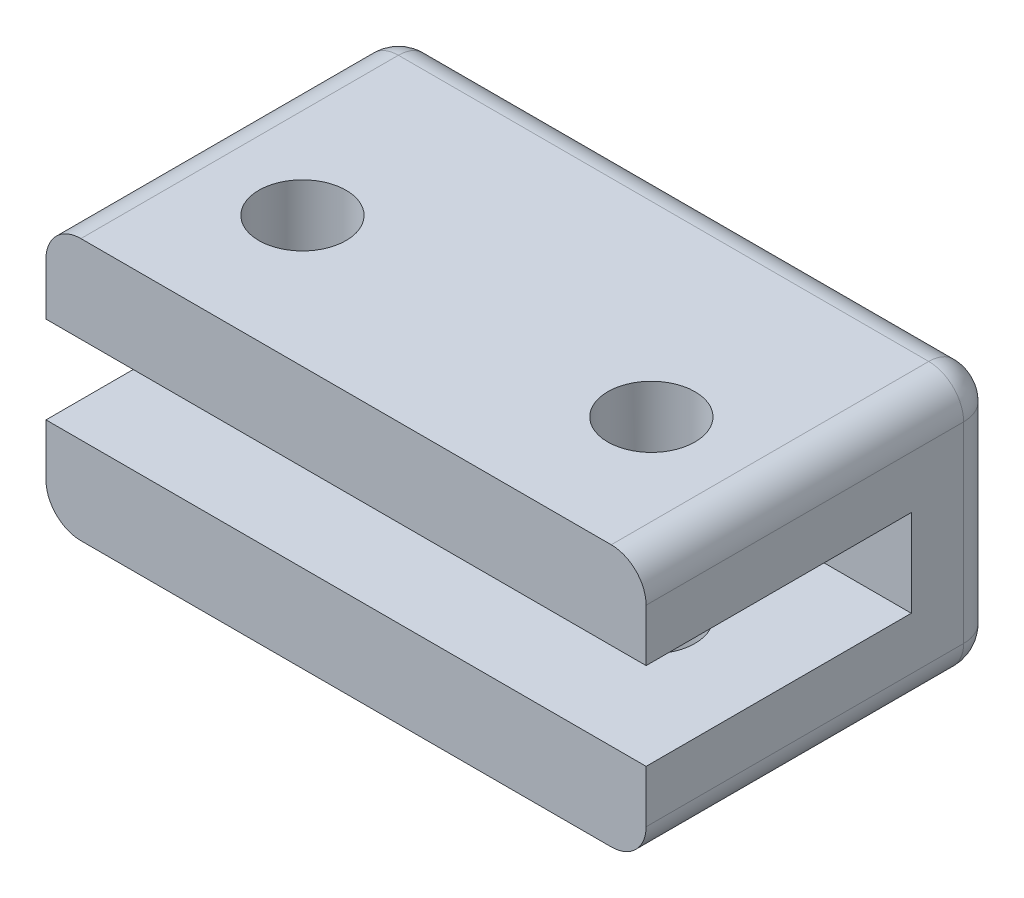
ISO-10303-21;
HEADER;
FILE_DESCRIPTION(('STEP AP214'),'2;1');
FILE_NAME('part.step','',(''),(''),'','','');
FILE_SCHEMA(('AUTOMOTIVE_DESIGN { 1 0 10303 214 1 1 1 1 }'));
ENDSEC;
DATA;
#1=APPLICATION_CONTEXT('core data for automotive mechanical design processes');
#2=APPLICATION_PROTOCOL_DEFINITION('international standard','automotive_design',2000,#1);
#3=PRODUCT_CONTEXT('',#1,'mechanical');
#4=PRODUCT('Part','Part','',(#3));
#5=PRODUCT_RELATED_PRODUCT_CATEGORY('part','',(#4));
#6=PRODUCT_DEFINITION_FORMATION('','',#4);
#7=PRODUCT_DEFINITION_CONTEXT('part definition',#1,'design');
#8=PRODUCT_DEFINITION('design','',#6,#7);
#9=PRODUCT_DEFINITION_SHAPE('','',#8);
#10=(LENGTH_UNIT() NAMED_UNIT(*) SI_UNIT(.MILLI.,.METRE.));
#11=(NAMED_UNIT(*) PLANE_ANGLE_UNIT() SI_UNIT($,.RADIAN.));
#12=(NAMED_UNIT(*) SI_UNIT($,.STERADIAN.) SOLID_ANGLE_UNIT());
#13=UNCERTAINTY_MEASURE_WITH_UNIT(LENGTH_MEASURE(1.E-05),#10,'distance_accuracy_value','');
#14=(GEOMETRIC_REPRESENTATION_CONTEXT(3) GLOBAL_UNCERTAINTY_ASSIGNED_CONTEXT((#13)) GLOBAL_UNIT_ASSIGNED_CONTEXT((#10,
#11,#12)) REPRESENTATION_CONTEXT('',''));
#15=CARTESIAN_POINT('',(0.,0.,0.));
#16=DIRECTION('',(0.,0.,1.));
#17=DIRECTION('',(1.,0.,0.));
#18=AXIS2_PLACEMENT_3D('',#15,#16,#17);
#19=CARTESIAN_POINT('',(0.,0.,12.827));
#20=DIRECTION('',(0.,0.,1.));
#21=DIRECTION('',(1.,0.,0.));
#22=AXIS2_PLACEMENT_3D('',#19,#20,#21);
#23=PLANE('',#22);
#24=DIRECTION('',(-1.,0.,0.));
#25=VECTOR('',#24,1.);
#26=CARTESIAN_POINT('',(10.922,1.5875,12.827));
#27=LINE('',#26,#25);
#28=CARTESIAN_POINT('',(10.922,1.5875,12.827));
#29=VERTEX_POINT('',#28);
#30=CARTESIAN_POINT('',(-10.922,1.5875,12.827));
#31=VERTEX_POINT('',#30);
#32=EDGE_CURVE('E170',#29,#31,#27,.T.);
#33=ORIENTED_EDGE('',*,*,#32,.F.);
#34=DIRECTION('',(0.,1.,0.));
#35=VECTOR('',#34,1.);
#36=CARTESIAN_POINT('',(10.922,4.7625,12.827));
#37=LINE('',#36,#35);
#38=CARTESIAN_POINT('',(10.922,3.4925,12.827));
#39=VERTEX_POINT('',#38);
#40=EDGE_CURVE('E180',#29,#39,#37,.T.);
#41=ORIENTED_EDGE('',*,*,#40,.T.);
#42=CARTESIAN_POINT('',(9.652,3.4925,12.827));
#43=DIRECTION('',(0.,0.,1.));
#44=DIRECTION('',(1.,0.,0.));
#45=AXIS2_PLACEMENT_3D('',#42,#43,#44);
#46=CIRCLE('',#45,1.27);
#47=CARTESIAN_POINT('',(9.652,4.7625,12.827));
#48=VERTEX_POINT('',#47);
#49=EDGE_CURVE('E219',#39,#48,#46,.T.);
#50=ORIENTED_EDGE('',*,*,#49,.T.);
#51=DIRECTION('',(-1.,0.,0.));
#52=VECTOR('',#51,1.);
#53=CARTESIAN_POINT('',(-10.922,4.7625,12.827));
#54=LINE('',#53,#52);
#55=CARTESIAN_POINT('',(-9.652,4.7625,12.827));
#56=VERTEX_POINT('',#55);
#57=EDGE_CURVE('E183',#48,#56,#54,.T.);
#58=ORIENTED_EDGE('',*,*,#57,.T.);
#59=CARTESIAN_POINT('',(-9.652,3.4925,12.827));
#60=DIRECTION('',(0.,0.,1.));
#61=DIRECTION('',(1.,0.,0.));
#62=AXIS2_PLACEMENT_3D('',#59,#60,#61);
#63=CIRCLE('',#62,1.27);
#64=CARTESIAN_POINT('',(-10.922,3.4925,12.827));
#65=VERTEX_POINT('',#64);
#66=EDGE_CURVE('E221',#56,#65,#63,.T.);
#67=ORIENTED_EDGE('',*,*,#66,.T.);
#68=DIRECTION('',(0.,-1.,0.));
#69=VECTOR('',#68,1.);
#70=CARTESIAN_POINT('',(-10.922,4.7625,12.827));
#71=LINE('',#70,#69);
#72=EDGE_CURVE('E173',#65,#31,#71,.T.);
#73=ORIENTED_EDGE('',*,*,#72,.T.);
#74=EDGE_LOOP('',(#33,#41,#50,#58,#67,#73));
#75=FACE_BOUND('',#74,.T.);
#76=ADVANCED_FACE('F33',(#75),#23,.T.);
#77=CARTESIAN_POINT('',(-10.922,4.7625,12.827));
#78=DIRECTION('',(1.,0.,0.));
#79=DIRECTION('',(0.,0.,-1.));
#80=AXIS2_PLACEMENT_3D('',#77,#78,#79);
#81=PLANE('',#80);
#82=DIRECTION('',(0.,-1.,0.));
#83=VECTOR('',#82,1.);
#84=CARTESIAN_POINT('',(-10.922,1.5875,3.175));
#85=LINE('',#84,#83);
#86=CARTESIAN_POINT('',(-10.922,1.5875,3.175));
#87=VERTEX_POINT('',#86);
#88=CARTESIAN_POINT('',(-10.922,-1.5875,3.175));
#89=VERTEX_POINT('',#88);
#90=EDGE_CURVE('E143',#87,#89,#85,.T.);
#91=ORIENTED_EDGE('',*,*,#90,.F.);
#92=DIRECTION('',(0.,0.,-1.));
#93=VECTOR('',#92,1.);
#94=CARTESIAN_POINT('',(-10.922,1.5875,3.175));
#95=LINE('',#94,#93);
#96=EDGE_CURVE('E156',#31,#87,#95,.T.);
#97=ORIENTED_EDGE('',*,*,#96,.F.);
#98=ORIENTED_EDGE('',*,*,#72,.F.);
#99=DIRECTION('',(0.,0.,-1.));
#100=VECTOR('',#99,1.);
#101=CARTESIAN_POINT('',(-10.922,3.4925,12.827));
#102=LINE('',#101,#100);
#103=CARTESIAN_POINT('',(-10.922,3.4925,1.27));
#104=VERTEX_POINT('',#103);
#105=EDGE_CURVE('E214',#65,#104,#102,.T.);
#106=ORIENTED_EDGE('',*,*,#105,.T.);
#107=DIRECTION('',(0.,-1.,0.));
#108=VECTOR('',#107,1.);
#109=CARTESIAN_POINT('',(-10.922,4.7625,1.27));
#110=LINE('',#109,#108);
#111=CARTESIAN_POINT('',(-10.922,-3.4925,1.27));
#112=VERTEX_POINT('',#111);
#113=EDGE_CURVE('E58',#104,#112,#110,.T.);
#114=ORIENTED_EDGE('',*,*,#113,.T.);
#115=DIRECTION('',(0.,0.,-1.));
#116=VECTOR('',#115,1.);
#117=CARTESIAN_POINT('',(-10.922,-3.4925,12.827));
#118=LINE('',#117,#116);
#119=CARTESIAN_POINT('',(-10.922,-3.4925,12.827));
#120=VERTEX_POINT('',#119);
#121=EDGE_CURVE('E217',#112,#120,#118,.F.);
#122=ORIENTED_EDGE('',*,*,#121,.T.);
#123=CARTESIAN_POINT('',(-10.922,-1.5875,12.827));
#124=VERTEX_POINT('',#123);
#125=EDGE_CURVE('E177',#124,#120,#71,.T.);
#126=ORIENTED_EDGE('',*,*,#125,.F.);
#127=DIRECTION('',(0.,0.,1.));
#128=VECTOR('',#127,1.);
#129=CARTESIAN_POINT('',(-10.922,-1.5875,3.175));
#130=LINE('',#129,#128);
#131=EDGE_CURVE('E50',#89,#124,#130,.T.);
#132=ORIENTED_EDGE('',*,*,#131,.F.);
#133=EDGE_LOOP('',(#91,#97,#98,#106,#114,#122,#126,#132));
#134=FACE_BOUND('',#133,.T.);
#135=ADVANCED_FACE('F305',(#134),#81,.F.);
#136=CARTESIAN_POINT('',(-10.922,-4.7625,12.827));
#137=DIRECTION('',(0.,1.,0.));
#138=DIRECTION('',(0.,0.,1.));
#139=AXIS2_PLACEMENT_3D('',#136,#137,#138);
#140=PLANE('',#139);
#141=CARTESIAN_POINT('',(6.35,-4.7625,8.0645));
#142=DIRECTION('',(0.,1.,0.));
#143=DIRECTION('',(0.,0.,-1.));
#144=AXIS2_PLACEMENT_3D('',#141,#142,#143);
#145=CIRCLE('',#144,1.5875);
#146=CARTESIAN_POINT('',(6.35,-4.7625,6.477));
#147=VERTEX_POINT('',#146);
#148=EDGE_CURVE('E276',#147,#147,#145,.T.);
#149=ORIENTED_EDGE('',*,*,#148,.T.);
#150=EDGE_LOOP('',(#149));
#151=FACE_BOUND('',#150,.T.);
#152=CARTESIAN_POINT('',(-6.35,-4.7625,8.0645));
#153=DIRECTION('',(0.,1.,0.));
#154=DIRECTION('',(0.,0.,1.));
#155=AXIS2_PLACEMENT_3D('',#152,#153,#154);
#156=CIRCLE('',#155,1.5875);
#157=CARTESIAN_POINT('',(-6.35,-4.7625,9.652));
#158=VERTEX_POINT('',#157);
#159=EDGE_CURVE('E259',#158,#158,#156,.T.);
#160=ORIENTED_EDGE('',*,*,#159,.T.);
#161=EDGE_LOOP('',(#160));
#162=FACE_BOUND('',#161,.T.);
#163=DIRECTION('',(1.,0.,0.));
#164=VECTOR('',#163,1.);
#165=CARTESIAN_POINT('',(-10.922,-4.7625,12.827));
#166=LINE('',#165,#164);
#167=CARTESIAN_POINT('',(-9.652,-4.7625,12.827));
#168=VERTEX_POINT('',#167);
#169=CARTESIAN_POINT('',(9.652,-4.7625,12.827));
#170=VERTEX_POINT('',#169);
#171=EDGE_CURVE('E176',#168,#170,#166,.T.);
#172=ORIENTED_EDGE('',*,*,#171,.F.);
#173=DIRECTION('',(0.,0.,-1.));
#174=VECTOR('',#173,1.);
#175=CARTESIAN_POINT('',(-9.652,-4.7625,12.827));
#176=LINE('',#175,#174);
#177=CARTESIAN_POINT('',(-9.652,-4.7625,1.27));
#178=VERTEX_POINT('',#177);
#179=EDGE_CURVE('E191',#168,#178,#176,.T.);
#180=ORIENTED_EDGE('',*,*,#179,.T.);
#181=DIRECTION('',(1.,0.,0.));
#182=VECTOR('',#181,1.);
#183=CARTESIAN_POINT('',(-10.922,-4.7625,1.27));
#184=LINE('',#183,#182);
#185=CARTESIAN_POINT('',(9.652,-4.7625,1.27));
#186=VERTEX_POINT('',#185);
#187=EDGE_CURVE('E188',#178,#186,#184,.T.);
#188=ORIENTED_EDGE('',*,*,#187,.T.);
#189=DIRECTION('',(0.,0.,-1.));
#190=VECTOR('',#189,1.);
#191=CARTESIAN_POINT('',(9.652,-4.7625,12.827));
#192=LINE('',#191,#190);
#193=EDGE_CURVE('E186',#186,#170,#192,.F.);
#194=ORIENTED_EDGE('',*,*,#193,.T.);
#195=EDGE_LOOP('',(#172,#180,#188,#194));
#196=FACE_BOUND('',#195,.T.);
#197=ADVANCED_FACE('F310',(#151,#162,#196),#140,.F.);
#198=CARTESIAN_POINT('',(10.922,4.7625,12.827));
#199=DIRECTION('',(-1.,0.,0.));
#200=DIRECTION('',(0.,0.,1.));
#201=AXIS2_PLACEMENT_3D('',#198,#199,#200);
#202=PLANE('',#201);
#203=ORIENTED_EDGE('',*,*,#40,.F.);
#204=DIRECTION('',(0.,0.,-1.));
#205=VECTOR('',#204,1.);
#206=CARTESIAN_POINT('',(10.922,1.5875,3.175));
#207=LINE('',#206,#205);
#208=CARTESIAN_POINT('',(10.922,1.5875,3.175));
#209=VERTEX_POINT('',#208);
#210=EDGE_CURVE('E145',#29,#209,#207,.T.);
#211=ORIENTED_EDGE('',*,*,#210,.T.);
#212=DIRECTION('',(0.,-1.,0.));
#213=VECTOR('',#212,1.);
#214=CARTESIAN_POINT('',(10.922,1.5875,3.175));
#215=LINE('',#214,#213);
#216=CARTESIAN_POINT('',(10.922,-1.5875,3.175));
#217=VERTEX_POINT('',#216);
#218=EDGE_CURVE('E140',#209,#217,#215,.T.);
#219=ORIENTED_EDGE('',*,*,#218,.T.);
#220=DIRECTION('',(0.,0.,1.));
#221=VECTOR('',#220,1.);
#222=CARTESIAN_POINT('',(10.922,-1.5875,3.175));
#223=LINE('',#222,#221);
#224=CARTESIAN_POINT('',(10.922,-1.5875,12.827));
#225=VERTEX_POINT('',#224);
#226=EDGE_CURVE('E148',#217,#225,#223,.T.);
#227=ORIENTED_EDGE('',*,*,#226,.T.);
#228=CARTESIAN_POINT('',(10.922,-3.4925,12.827));
#229=VERTEX_POINT('',#228);
#230=EDGE_CURVE('E181',#229,#225,#37,.T.);
#231=ORIENTED_EDGE('',*,*,#230,.F.);
#232=DIRECTION('',(0.,0.,-1.));
#233=VECTOR('',#232,1.);
#234=CARTESIAN_POINT('',(10.922,-3.4925,12.827));
#235=LINE('',#234,#233);
#236=CARTESIAN_POINT('',(10.922,-3.4925,1.27));
#237=VERTEX_POINT('',#236);
#238=EDGE_CURVE('E206',#229,#237,#235,.T.);
#239=ORIENTED_EDGE('',*,*,#238,.T.);
#240=DIRECTION('',(0.,1.,0.));
#241=VECTOR('',#240,1.);
#242=CARTESIAN_POINT('',(10.922,4.7625,1.27));
#243=LINE('',#242,#241);
#244=CARTESIAN_POINT('',(10.922,3.4925,1.27));
#245=VERTEX_POINT('',#244);
#246=EDGE_CURVE('E204',#237,#245,#243,.T.);
#247=ORIENTED_EDGE('',*,*,#246,.T.);
#248=DIRECTION('',(0.,0.,-1.));
#249=VECTOR('',#248,1.);
#250=CARTESIAN_POINT('',(10.922,3.4925,12.827));
#251=LINE('',#250,#249);
#252=EDGE_CURVE('E201',#245,#39,#251,.F.);
#253=ORIENTED_EDGE('',*,*,#252,.T.);
#254=EDGE_LOOP('',(#203,#211,#219,#227,#231,#239,#247,#253));
#255=FACE_BOUND('',#254,.T.);
#256=ADVANCED_FACE('F155',(#255),#202,.F.);
#257=CARTESIAN_POINT('',(-10.922,4.7625,12.827));
#258=DIRECTION('',(0.,-1.,0.));
#259=DIRECTION('',(0.,0.,-1.));
#260=AXIS2_PLACEMENT_3D('',#257,#258,#259);
#261=PLANE('',#260);
#262=CARTESIAN_POINT('',(6.35,4.7625,8.0645));
#263=DIRECTION('',(0.,1.,0.));
#264=DIRECTION('',(0.,0.,-1.));
#265=AXIS2_PLACEMENT_3D('',#262,#263,#264);
#266=CIRCLE('',#265,1.5875);
#267=CARTESIAN_POINT('',(6.35,4.7625,6.477));
#268=VERTEX_POINT('',#267);
#269=EDGE_CURVE('E273',#268,#268,#266,.T.);
#270=ORIENTED_EDGE('',*,*,#269,.F.);
#271=EDGE_LOOP('',(#270));
#272=FACE_BOUND('',#271,.T.);
#273=CARTESIAN_POINT('',(-6.35,4.7625,8.0645));
#274=DIRECTION('',(0.,1.,0.));
#275=DIRECTION('',(0.,0.,1.));
#276=AXIS2_PLACEMENT_3D('',#273,#274,#275);
#277=CIRCLE('',#276,1.5875);
#278=CARTESIAN_POINT('',(-6.35,4.7625,9.652));
#279=VERTEX_POINT('',#278);
#280=EDGE_CURVE('E264',#279,#279,#277,.T.);
#281=ORIENTED_EDGE('',*,*,#280,.F.);
#282=EDGE_LOOP('',(#281));
#283=FACE_BOUND('',#282,.T.);
#284=DIRECTION('',(-1.,0.,0.));
#285=VECTOR('',#284,1.);
#286=CARTESIAN_POINT('',(-10.922,4.7625,1.27));
#287=LINE('',#286,#285);
#288=CARTESIAN_POINT('',(9.652,4.7625,1.27));
#289=VERTEX_POINT('',#288);
#290=CARTESIAN_POINT('',(-9.652,4.7625,1.27));
#291=VERTEX_POINT('',#290);
#292=EDGE_CURVE('E210',#289,#291,#287,.T.);
#293=ORIENTED_EDGE('',*,*,#292,.T.);
#294=DIRECTION('',(0.,0.,-1.));
#295=VECTOR('',#294,1.);
#296=CARTESIAN_POINT('',(-9.652,4.7625,12.827));
#297=LINE('',#296,#295);
#298=EDGE_CURVE('E212',#291,#56,#297,.F.);
#299=ORIENTED_EDGE('',*,*,#298,.T.);
#300=ORIENTED_EDGE('',*,*,#57,.F.);
#301=DIRECTION('',(0.,0.,-1.));
#302=VECTOR('',#301,1.);
#303=CARTESIAN_POINT('',(9.652,4.7625,12.827));
#304=LINE('',#303,#302);
#305=EDGE_CURVE('E208',#48,#289,#304,.T.);
#306=ORIENTED_EDGE('',*,*,#305,.T.);
#307=EDGE_LOOP('',(#293,#299,#300,#306));
#308=FACE_BOUND('',#307,.T.);
#309=ADVANCED_FACE('F300',(#272,#283,#308),#261,.F.);
#310=DIRECTION('',(-1.,0.,0.));
#311=VECTOR('',#310,1.);
#312=CARTESIAN_POINT('',(10.922,-1.5875,12.827));
#313=LINE('',#312,#311);
#314=EDGE_CURVE('E144',#225,#124,#313,.T.);
#315=ORIENTED_EDGE('',*,*,#314,.T.);
#316=ORIENTED_EDGE('',*,*,#125,.T.);
#317=CARTESIAN_POINT('',(-9.652,-3.4925,12.827));
#318=DIRECTION('',(0.,0.,1.));
#319=DIRECTION('',(1.,0.,0.));
#320=AXIS2_PLACEMENT_3D('',#317,#318,#319);
#321=CIRCLE('',#320,1.27);
#322=EDGE_CURVE('E11',#120,#168,#321,.T.);
#323=ORIENTED_EDGE('',*,*,#322,.T.);
#324=ORIENTED_EDGE('',*,*,#171,.T.);
#325=CARTESIAN_POINT('',(9.652,-3.4925,12.827));
#326=DIRECTION('',(0.,0.,1.));
#327=DIRECTION('',(1.,0.,0.));
#328=AXIS2_PLACEMENT_3D('',#325,#326,#327);
#329=CIRCLE('',#328,1.27);
#330=EDGE_CURVE('E42',#170,#229,#329,.T.);
#331=ORIENTED_EDGE('',*,*,#330,.T.);
#332=ORIENTED_EDGE('',*,*,#230,.T.);
#333=EDGE_LOOP('',(#315,#316,#323,#324,#331,#332));
#334=FACE_BOUND('',#333,.T.);
#335=ADVANCED_FACE('F291',(#334),#23,.T.);
#336=CARTESIAN_POINT('',(0.,0.,0.));
#337=DIRECTION('',(0.,0.,1.));
#338=DIRECTION('',(1.,0.,0.));
#339=AXIS2_PLACEMENT_3D('',#336,#337,#338);
#340=PLANE('',#339);
#341=DIRECTION('',(-1.,0.,0.));
#342=VECTOR('',#341,1.);
#343=CARTESIAN_POINT('',(0.,3.4925,0.));
#344=LINE('',#343,#342);
#345=CARTESIAN_POINT('',(-9.652,3.4925,0.));
#346=VERTEX_POINT('',#345);
#347=CARTESIAN_POINT('',(9.652,3.4925,0.));
#348=VERTEX_POINT('',#347);
#349=EDGE_CURVE('E195',#346,#348,#344,.F.);
#350=ORIENTED_EDGE('',*,*,#349,.T.);
#351=DIRECTION('',(0.,1.,0.));
#352=VECTOR('',#351,1.);
#353=CARTESIAN_POINT('',(9.652,0.,0.));
#354=LINE('',#353,#352);
#355=CARTESIAN_POINT('',(9.652,-3.4925,0.));
#356=VERTEX_POINT('',#355);
#357=EDGE_CURVE('E197',#348,#356,#354,.F.);
#358=ORIENTED_EDGE('',*,*,#357,.T.);
#359=DIRECTION('',(1.,0.,0.));
#360=VECTOR('',#359,1.);
#361=CARTESIAN_POINT('',(0.,-3.4925,0.));
#362=LINE('',#361,#360);
#363=CARTESIAN_POINT('',(-9.652,-3.4925,0.));
#364=VERTEX_POINT('',#363);
#365=EDGE_CURVE('E199',#356,#364,#362,.F.);
#366=ORIENTED_EDGE('',*,*,#365,.T.);
#367=DIRECTION('',(0.,-1.,0.));
#368=VECTOR('',#367,1.);
#369=CARTESIAN_POINT('',(-9.652,0.,0.));
#370=LINE('',#369,#368);
#371=EDGE_CURVE('E193',#364,#346,#370,.F.);
#372=ORIENTED_EDGE('',*,*,#371,.T.);
#373=EDGE_LOOP('',(#350,#358,#366,#372));
#374=FACE_BOUND('',#373,.T.);
#375=CARTESIAN_POINT('',(0.,0.,0.));
#376=DIRECTION('',(0.,0.,1.));
#377=DIRECTION('',(1.,0.,0.));
#378=AXIS2_PLACEMENT_3D('',#375,#376,#377);
#379=CIRCLE('',#378,1.1303);
#380=CARTESIAN_POINT('',(1.1303,0.,0.));
#381=VERTEX_POINT('',#380);
#382=EDGE_CURVE('E282',#381,#381,#379,.F.);
#383=ORIENTED_EDGE('',*,*,#382,.F.);
#384=EDGE_LOOP('',(#383));
#385=FACE_BOUND('',#384,.T.);
#386=ADVANCED_FACE('F289',(#374,#385),#340,.F.);
#387=CARTESIAN_POINT('',(-9.652,3.4925,12.827));
#388=DIRECTION('',(0.,0.,-1.));
#389=DIRECTION('',(-1.,0.,0.));
#390=AXIS2_PLACEMENT_3D('',#387,#388,#389);
#391=CYLINDRICAL_SURFACE('',#390,1.27);
#392=ORIENTED_EDGE('',*,*,#66,.F.);
#393=ORIENTED_EDGE('',*,*,#298,.F.);
#394=CARTESIAN_POINT('',(-9.652,3.4925,1.27));
#395=DIRECTION('',(0.,0.,-1.));
#396=DIRECTION('',(-1.,0.,0.));
#397=AXIS2_PLACEMENT_3D('',#394,#395,#396);
#398=CIRCLE('',#397,1.27);
#399=EDGE_CURVE('E252',#104,#291,#398,.T.);
#400=ORIENTED_EDGE('',*,*,#399,.F.);
#401=ORIENTED_EDGE('',*,*,#105,.F.);
#402=EDGE_LOOP('',(#392,#393,#400,#401));
#403=FACE_BOUND('',#402,.T.);
#404=ADVANCED_FACE('F35',(#403),#391,.T.);
#405=CARTESIAN_POINT('',(9.652,3.4925,12.827));
#406=DIRECTION('',(0.,0.,-1.));
#407=DIRECTION('',(-1.,0.,0.));
#408=AXIS2_PLACEMENT_3D('',#405,#406,#407);
#409=CYLINDRICAL_SURFACE('',#408,1.27);
#410=ORIENTED_EDGE('',*,*,#49,.F.);
#411=ORIENTED_EDGE('',*,*,#252,.F.);
#412=CARTESIAN_POINT('',(9.652,3.4925,1.27));
#413=DIRECTION('',(0.,0.,-1.));
#414=DIRECTION('',(-1.,0.,0.));
#415=AXIS2_PLACEMENT_3D('',#412,#413,#414);
#416=CIRCLE('',#415,1.27);
#417=EDGE_CURVE('E249',#289,#245,#416,.T.);
#418=ORIENTED_EDGE('',*,*,#417,.F.);
#419=ORIENTED_EDGE('',*,*,#305,.F.);
#420=EDGE_LOOP('',(#410,#411,#418,#419));
#421=FACE_BOUND('',#420,.T.);
#422=ADVANCED_FACE('F298',(#421),#409,.T.);
#423=CARTESIAN_POINT('',(-10.922,3.4925,1.27));
#424=DIRECTION('',(-1.,0.,0.));
#425=DIRECTION('',(0.,0.,1.));
#426=AXIS2_PLACEMENT_3D('',#423,#424,#425);
#427=CYLINDRICAL_SURFACE('',#426,1.27);
#428=CARTESIAN_POINT('',(-9.652,3.4925,1.27));
#429=DIRECTION('',(-1.,0.,0.));
#430=DIRECTION('',(0.,0.,1.));
#431=AXIS2_PLACEMENT_3D('',#428,#429,#430);
#432=CIRCLE('',#431,1.27);
#433=EDGE_CURVE('E255',#291,#346,#432,.T.);
#434=ORIENTED_EDGE('',*,*,#433,.F.);
#435=ORIENTED_EDGE('',*,*,#292,.F.);
#436=CARTESIAN_POINT('',(9.652,3.4925,1.27));
#437=DIRECTION('',(1.,0.,0.));
#438=DIRECTION('',(0.,0.,-1.));
#439=AXIS2_PLACEMENT_3D('',#436,#437,#438);
#440=CIRCLE('',#439,1.27);
#441=EDGE_CURVE('E246',#348,#289,#440,.T.);
#442=ORIENTED_EDGE('',*,*,#441,.F.);
#443=ORIENTED_EDGE('',*,*,#349,.F.);
#444=EDGE_LOOP('',(#434,#435,#442,#443));
#445=FACE_BOUND('',#444,.T.);
#446=ADVANCED_FACE('F442',(#445),#427,.T.);
#447=CARTESIAN_POINT('',(-9.652,3.4925,1.27));
#448=DIRECTION('',(0.,0.,1.));
#449=DIRECTION('',(1.,0.,0.));
#450=AXIS2_PLACEMENT_3D('',#447,#448,#449);
#451=SPHERICAL_SURFACE('',#450,1.27);
#452=ORIENTED_EDGE('',*,*,#399,.T.);
#453=ORIENTED_EDGE('',*,*,#433,.T.);
#454=CARTESIAN_POINT('',(-9.652,3.4925,1.27));
#455=DIRECTION('',(0.,1.,0.));
#456=DIRECTION('',(0.,0.,1.));
#457=AXIS2_PLACEMENT_3D('',#454,#455,#456);
#458=CIRCLE('',#457,1.27);
#459=EDGE_CURVE('E243',#104,#346,#458,.F.);
#460=ORIENTED_EDGE('',*,*,#459,.F.);
#461=EDGE_LOOP('',(#452,#453,#460));
#462=FACE_BOUND('',#461,.T.);
#463=ADVANCED_FACE('F434',(#462),#451,.T.);
#464=CARTESIAN_POINT('',(9.652,3.4925,1.27));
#465=DIRECTION('',(0.,0.,1.));
#466=DIRECTION('',(1.,0.,0.));
#467=AXIS2_PLACEMENT_3D('',#464,#465,#466);
#468=SPHERICAL_SURFACE('',#467,1.27);
#469=ORIENTED_EDGE('',*,*,#441,.T.);
#470=ORIENTED_EDGE('',*,*,#417,.T.);
#471=CARTESIAN_POINT('',(9.652,3.4925,1.27));
#472=DIRECTION('',(0.,1.,0.));
#473=DIRECTION('',(0.,0.,1.));
#474=AXIS2_PLACEMENT_3D('',#471,#472,#473);
#475=CIRCLE('',#474,1.27);
#476=EDGE_CURVE('E240',#348,#245,#475,.F.);
#477=ORIENTED_EDGE('',*,*,#476,.F.);
#478=EDGE_LOOP('',(#469,#470,#477));
#479=FACE_BOUND('',#478,.T.);
#480=ADVANCED_FACE('F426',(#479),#468,.T.);
#481=CARTESIAN_POINT('',(-9.652,4.7625,1.27));
#482=DIRECTION('',(0.,-1.,0.));
#483=DIRECTION('',(0.,0.,-1.));
#484=AXIS2_PLACEMENT_3D('',#481,#482,#483);
#485=CYLINDRICAL_SURFACE('',#484,1.27);
#486=ORIENTED_EDGE('',*,*,#459,.T.);
#487=ORIENTED_EDGE('',*,*,#371,.F.);
#488=CARTESIAN_POINT('',(-9.652,-3.4925,1.27));
#489=DIRECTION('',(0.,-1.,0.));
#490=DIRECTION('',(0.,0.,-1.));
#491=AXIS2_PLACEMENT_3D('',#488,#489,#490);
#492=CIRCLE('',#491,1.27);
#493=EDGE_CURVE('E237',#112,#364,#492,.T.);
#494=ORIENTED_EDGE('',*,*,#493,.F.);
#495=ORIENTED_EDGE('',*,*,#113,.F.);
#496=EDGE_LOOP('',(#486,#487,#494,#495));
#497=FACE_BOUND('',#496,.T.);
#498=ADVANCED_FACE('F418',(#497),#485,.T.);
#499=CARTESIAN_POINT('',(-9.652,-3.4925,12.827));
#500=DIRECTION('',(0.,0.,-1.));
#501=DIRECTION('',(-1.,0.,0.));
#502=AXIS2_PLACEMENT_3D('',#499,#500,#501);
#503=CYLINDRICAL_SURFACE('',#502,1.27);
#504=ORIENTED_EDGE('',*,*,#322,.F.);
#505=ORIENTED_EDGE('',*,*,#121,.F.);
#506=CARTESIAN_POINT('',(-9.652,-3.4925,1.27));
#507=DIRECTION('',(0.,0.,-1.));
#508=DIRECTION('',(-1.,0.,0.));
#509=AXIS2_PLACEMENT_3D('',#506,#507,#508);
#510=CIRCLE('',#509,1.27);
#511=EDGE_CURVE('E234',#178,#112,#510,.T.);
#512=ORIENTED_EDGE('',*,*,#511,.F.);
#513=ORIENTED_EDGE('',*,*,#179,.F.);
#514=EDGE_LOOP('',(#504,#505,#512,#513));
#515=FACE_BOUND('',#514,.T.);
#516=ADVANCED_FACE('F410',(#515),#503,.T.);
#517=CARTESIAN_POINT('',(9.652,-3.4925,12.827));
#518=DIRECTION('',(0.,0.,-1.));
#519=DIRECTION('',(-1.,0.,0.));
#520=AXIS2_PLACEMENT_3D('',#517,#518,#519);
#521=CYLINDRICAL_SURFACE('',#520,1.27);
#522=ORIENTED_EDGE('',*,*,#330,.F.);
#523=ORIENTED_EDGE('',*,*,#193,.F.);
#524=CARTESIAN_POINT('',(9.652,-3.4925,1.27));
#525=DIRECTION('',(0.,0.,-1.));
#526=DIRECTION('',(-1.,0.,0.));
#527=AXIS2_PLACEMENT_3D('',#524,#525,#526);
#528=CIRCLE('',#527,1.27);
#529=EDGE_CURVE('E231',#237,#186,#528,.T.);
#530=ORIENTED_EDGE('',*,*,#529,.F.);
#531=ORIENTED_EDGE('',*,*,#238,.F.);
#532=EDGE_LOOP('',(#522,#523,#530,#531));
#533=FACE_BOUND('',#532,.T.);
#534=ADVANCED_FACE('F402',(#533),#521,.T.);
#535=CARTESIAN_POINT('',(9.652,4.7625,1.27));
#536=DIRECTION('',(0.,1.,0.));
#537=DIRECTION('',(0.,0.,1.));
#538=AXIS2_PLACEMENT_3D('',#535,#536,#537);
#539=CYLINDRICAL_SURFACE('',#538,1.27);
#540=ORIENTED_EDGE('',*,*,#476,.T.);
#541=ORIENTED_EDGE('',*,*,#246,.F.);
#542=CARTESIAN_POINT('',(9.652,-3.4925,1.27));
#543=DIRECTION('',(0.,-1.,0.));
#544=DIRECTION('',(1.,0.,0.));
#545=AXIS2_PLACEMENT_3D('',#542,#543,#544);
#546=CIRCLE('',#545,1.27);
#547=EDGE_CURVE('E228',#356,#237,#546,.T.);
#548=ORIENTED_EDGE('',*,*,#547,.F.);
#549=ORIENTED_EDGE('',*,*,#357,.F.);
#550=EDGE_LOOP('',(#540,#541,#548,#549));
#551=FACE_BOUND('',#550,.T.);
#552=ADVANCED_FACE('F394',(#551),#539,.T.);
#553=CARTESIAN_POINT('',(-9.652,-3.4925,1.27));
#554=DIRECTION('',(0.,0.,1.));
#555=DIRECTION('',(1.,0.,0.));
#556=AXIS2_PLACEMENT_3D('',#553,#554,#555);
#557=SPHERICAL_SURFACE('',#556,1.27);
#558=ORIENTED_EDGE('',*,*,#511,.T.);
#559=ORIENTED_EDGE('',*,*,#493,.T.);
#560=CARTESIAN_POINT('',(-9.652,-3.4925,1.27));
#561=DIRECTION('',(-1.,0.,0.));
#562=DIRECTION('',(0.,0.,1.));
#563=AXIS2_PLACEMENT_3D('',#560,#561,#562);
#564=CIRCLE('',#563,1.27);
#565=EDGE_CURVE('E225',#178,#364,#564,.F.);
#566=ORIENTED_EDGE('',*,*,#565,.F.);
#567=EDGE_LOOP('',(#558,#559,#566));
#568=FACE_BOUND('',#567,.T.);
#569=ADVANCED_FACE('F386',(#568),#557,.T.);
#570=CARTESIAN_POINT('',(9.652,-3.4925,1.27));
#571=DIRECTION('',(0.,0.,1.));
#572=DIRECTION('',(1.,0.,0.));
#573=AXIS2_PLACEMENT_3D('',#570,#571,#572);
#574=SPHERICAL_SURFACE('',#573,1.27);
#575=ORIENTED_EDGE('',*,*,#547,.T.);
#576=ORIENTED_EDGE('',*,*,#529,.T.);
#577=CARTESIAN_POINT('',(9.652,-3.4925,1.27));
#578=DIRECTION('',(1.,0.,0.));
#579=DIRECTION('',(0.,0.,-1.));
#580=AXIS2_PLACEMENT_3D('',#577,#578,#579);
#581=CIRCLE('',#580,1.27);
#582=EDGE_CURVE('E169',#356,#186,#581,.F.);
#583=ORIENTED_EDGE('',*,*,#582,.F.);
#584=EDGE_LOOP('',(#575,#576,#583));
#585=FACE_BOUND('',#584,.T.);
#586=ADVANCED_FACE('F377',(#585),#574,.T.);
#587=CARTESIAN_POINT('',(-10.922,-3.4925,1.27));
#588=DIRECTION('',(1.,0.,0.));
#589=DIRECTION('',(0.,0.,-1.));
#590=AXIS2_PLACEMENT_3D('',#587,#588,#589);
#591=CYLINDRICAL_SURFACE('',#590,1.27);
#592=ORIENTED_EDGE('',*,*,#565,.T.);
#593=ORIENTED_EDGE('',*,*,#365,.F.);
#594=ORIENTED_EDGE('',*,*,#582,.T.);
#595=ORIENTED_EDGE('',*,*,#187,.F.);
#596=EDGE_LOOP('',(#592,#593,#594,#595));
#597=FACE_BOUND('',#596,.T.);
#598=ADVANCED_FACE('F317',(#597),#591,.T.);
#599=CARTESIAN_POINT('',(10.922,1.5875,3.175));
#600=DIRECTION('',(0.,0.,-1.));
#601=DIRECTION('',(-1.,0.,0.));
#602=AXIS2_PLACEMENT_3D('',#599,#600,#601);
#603=PLANE('',#602);
#604=CARTESIAN_POINT('',(0.,0.,3.175));
#605=DIRECTION('',(0.,0.,-1.));
#606=DIRECTION('',(-1.,0.,0.));
#607=AXIS2_PLACEMENT_3D('',#604,#605,#606);
#608=CIRCLE('',#607,1.1303);
#609=CARTESIAN_POINT('',(-1.1303,0.,3.175));
#610=VERTEX_POINT('',#609);
#611=EDGE_CURVE('E277',#610,#610,#608,.F.);
#612=ORIENTED_EDGE('',*,*,#611,.F.);
#613=EDGE_LOOP('',(#612));
#614=FACE_BOUND('',#613,.T.);
#615=ORIENTED_EDGE('',*,*,#90,.T.);
#616=DIRECTION('',(-1.,0.,0.));
#617=VECTOR('',#616,1.);
#618=CARTESIAN_POINT('',(10.922,-1.5875,3.175));
#619=LINE('',#618,#617);
#620=EDGE_CURVE('E136',#217,#89,#619,.T.);
#621=ORIENTED_EDGE('',*,*,#620,.F.);
#622=ORIENTED_EDGE('',*,*,#218,.F.);
#623=DIRECTION('',(-1.,0.,0.));
#624=VECTOR('',#623,1.);
#625=CARTESIAN_POINT('',(10.922,1.5875,3.175));
#626=LINE('',#625,#624);
#627=EDGE_CURVE('E167',#209,#87,#626,.T.);
#628=ORIENTED_EDGE('',*,*,#627,.T.);
#629=EDGE_LOOP('',(#615,#621,#622,#628));
#630=FACE_BOUND('',#629,.T.);
#631=ADVANCED_FACE('F138',(#614,#630),#603,.F.);
#632=CARTESIAN_POINT('',(10.922,1.5875,3.175));
#633=DIRECTION('',(0.,1.,0.));
#634=DIRECTION('',(0.,0.,1.));
#635=AXIS2_PLACEMENT_3D('',#632,#633,#634);
#636=PLANE('',#635);
#637=CARTESIAN_POINT('',(6.35,1.5875,8.0645));
#638=DIRECTION('',(0.,1.,0.));
#639=DIRECTION('',(0.,0.,1.));
#640=AXIS2_PLACEMENT_3D('',#637,#638,#639);
#641=CIRCLE('',#640,1.5875);
#642=CARTESIAN_POINT('',(6.35,1.5875,9.652));
#643=VERTEX_POINT('',#642);
#644=EDGE_CURVE('E269',#643,#643,#641,.T.);
#645=ORIENTED_EDGE('',*,*,#644,.T.);
#646=EDGE_LOOP('',(#645));
#647=FACE_BOUND('',#646,.T.);
#648=CARTESIAN_POINT('',(-6.35,1.5875,8.0645));
#649=DIRECTION('',(0.,1.,0.));
#650=DIRECTION('',(0.,0.,1.));
#651=AXIS2_PLACEMENT_3D('',#648,#649,#650);
#652=CIRCLE('',#651,1.5875);
#653=CARTESIAN_POINT('',(-6.35,1.5875,9.652));
#654=VERTEX_POINT('',#653);
#655=EDGE_CURVE('E161',#654,#654,#652,.T.);
#656=ORIENTED_EDGE('',*,*,#655,.T.);
#657=EDGE_LOOP('',(#656));
#658=FACE_BOUND('',#657,.T.);
#659=ORIENTED_EDGE('',*,*,#96,.T.);
#660=ORIENTED_EDGE('',*,*,#627,.F.);
#661=ORIENTED_EDGE('',*,*,#210,.F.);
#662=ORIENTED_EDGE('',*,*,#32,.T.);
#663=EDGE_LOOP('',(#659,#660,#661,#662));
#664=FACE_BOUND('',#663,.T.);
#665=ADVANCED_FACE('F316',(#647,#658,#664),#636,.F.);
#666=CARTESIAN_POINT('',(10.922,-1.5875,3.175));
#667=DIRECTION('',(0.,-1.,0.));
#668=DIRECTION('',(0.,0.,-1.));
#669=AXIS2_PLACEMENT_3D('',#666,#667,#668);
#670=PLANE('',#669);
#671=CARTESIAN_POINT('',(6.35,-1.5875,8.0645));
#672=DIRECTION('',(0.,-1.,0.));
#673=DIRECTION('',(0.,0.,-1.));
#674=AXIS2_PLACEMENT_3D('',#671,#672,#673);
#675=CIRCLE('',#674,1.5875);
#676=CARTESIAN_POINT('',(6.35,-1.5875,6.477));
#677=VERTEX_POINT('',#676);
#678=EDGE_CURVE('E37',#677,#677,#675,.T.);
#679=ORIENTED_EDGE('',*,*,#678,.T.);
#680=EDGE_LOOP('',(#679));
#681=FACE_BOUND('',#680,.T.);
#682=CARTESIAN_POINT('',(-6.35,-1.5875,8.0645));
#683=DIRECTION('',(0.,-1.,0.));
#684=DIRECTION('',(0.,0.,-1.));
#685=AXIS2_PLACEMENT_3D('',#682,#683,#684);
#686=CIRCLE('',#685,1.5875);
#687=CARTESIAN_POINT('',(-6.35,-1.5875,6.477));
#688=VERTEX_POINT('',#687);
#689=EDGE_CURVE('E257',#688,#688,#686,.T.);
#690=ORIENTED_EDGE('',*,*,#689,.T.);
#691=EDGE_LOOP('',(#690));
#692=FACE_BOUND('',#691,.T.);
#693=ORIENTED_EDGE('',*,*,#131,.T.);
#694=ORIENTED_EDGE('',*,*,#314,.F.);
#695=ORIENTED_EDGE('',*,*,#226,.F.);
#696=ORIENTED_EDGE('',*,*,#620,.T.);
#697=EDGE_LOOP('',(#693,#694,#695,#696));
#698=FACE_BOUND('',#697,.T.);
#699=ADVANCED_FACE('F149',(#681,#692,#698),#670,.F.);
#700=CARTESIAN_POINT('',(-6.35,-4.7625,8.0645));
#701=DIRECTION('',(0.,1.,0.));
#702=DIRECTION('',(0.,0.,1.));
#703=AXIS2_PLACEMENT_3D('',#700,#701,#702);
#704=CYLINDRICAL_SURFACE('',#703,1.5875);
#705=ORIENTED_EDGE('',*,*,#159,.F.);
#706=EDGE_LOOP('',(#705));
#707=FACE_BOUND('',#706,.T.);
#708=ORIENTED_EDGE('',*,*,#689,.F.);
#709=EDGE_LOOP('',(#708));
#710=FACE_BOUND('',#709,.T.);
#711=ADVANCED_FACE('F321',(#707,#710),#704,.F.);
#712=ORIENTED_EDGE('',*,*,#280,.T.);
#713=EDGE_LOOP('',(#712));
#714=FACE_BOUND('',#713,.T.);
#715=ORIENTED_EDGE('',*,*,#655,.F.);
#716=EDGE_LOOP('',(#715));
#717=FACE_BOUND('',#716,.T.);
#718=ADVANCED_FACE('F326',(#714,#717),#704,.F.);
#719=CARTESIAN_POINT('',(6.35,-4.7625,8.0645));
#720=DIRECTION('',(0.,1.,0.));
#721=DIRECTION('',(0.,0.,1.));
#722=AXIS2_PLACEMENT_3D('',#719,#720,#721);
#723=CYLINDRICAL_SURFACE('',#722,1.5875);
#724=ORIENTED_EDGE('',*,*,#148,.F.);
#725=EDGE_LOOP('',(#724));
#726=FACE_BOUND('',#725,.T.);
#727=ORIENTED_EDGE('',*,*,#678,.F.);
#728=EDGE_LOOP('',(#727));
#729=FACE_BOUND('',#728,.T.);
#730=ADVANCED_FACE('F329',(#726,#729),#723,.F.);
#731=ORIENTED_EDGE('',*,*,#269,.T.);
#732=EDGE_LOOP('',(#731));
#733=FACE_BOUND('',#732,.T.);
#734=ORIENTED_EDGE('',*,*,#644,.F.);
#735=EDGE_LOOP('',(#734));
#736=FACE_BOUND('',#735,.T.);
#737=ADVANCED_FACE('F331',(#733,#736),#723,.F.);
#738=CARTESIAN_POINT('',(0.,0.,12.828));
#739=DIRECTION('',(0.,0.,-1.));
#740=DIRECTION('',(-1.,0.,0.));
#741=AXIS2_PLACEMENT_3D('',#738,#739,#740);
#742=CYLINDRICAL_SURFACE('',#741,1.1303);
#743=ORIENTED_EDGE('',*,*,#382,.T.);
#744=EDGE_LOOP('',(#743));
#745=FACE_BOUND('',#744,.T.);
#746=ORIENTED_EDGE('',*,*,#611,.T.);
#747=EDGE_LOOP('',(#746));
#748=FACE_BOUND('',#747,.T.);
#749=ADVANCED_FACE('F286',(#745,#748),#742,.F.);
#750=CLOSED_SHELL('',(#76,#135,#197,#256,#309,#335,#386,#404,#422,#446,#463,#480,#498,#516,#534,
#552,#569,#586,#598,#631,#665,#699,#711,#718,#730,#737,#749));
#751=MANIFOLD_SOLID_BREP('B2',#750);
#752=ADVANCED_BREP_SHAPE_REPRESENTATION('',(#18,#751),#14);
#753=SHAPE_DEFINITION_REPRESENTATION(#9,#752);
ENDSEC;
END-ISO-10303-21;
